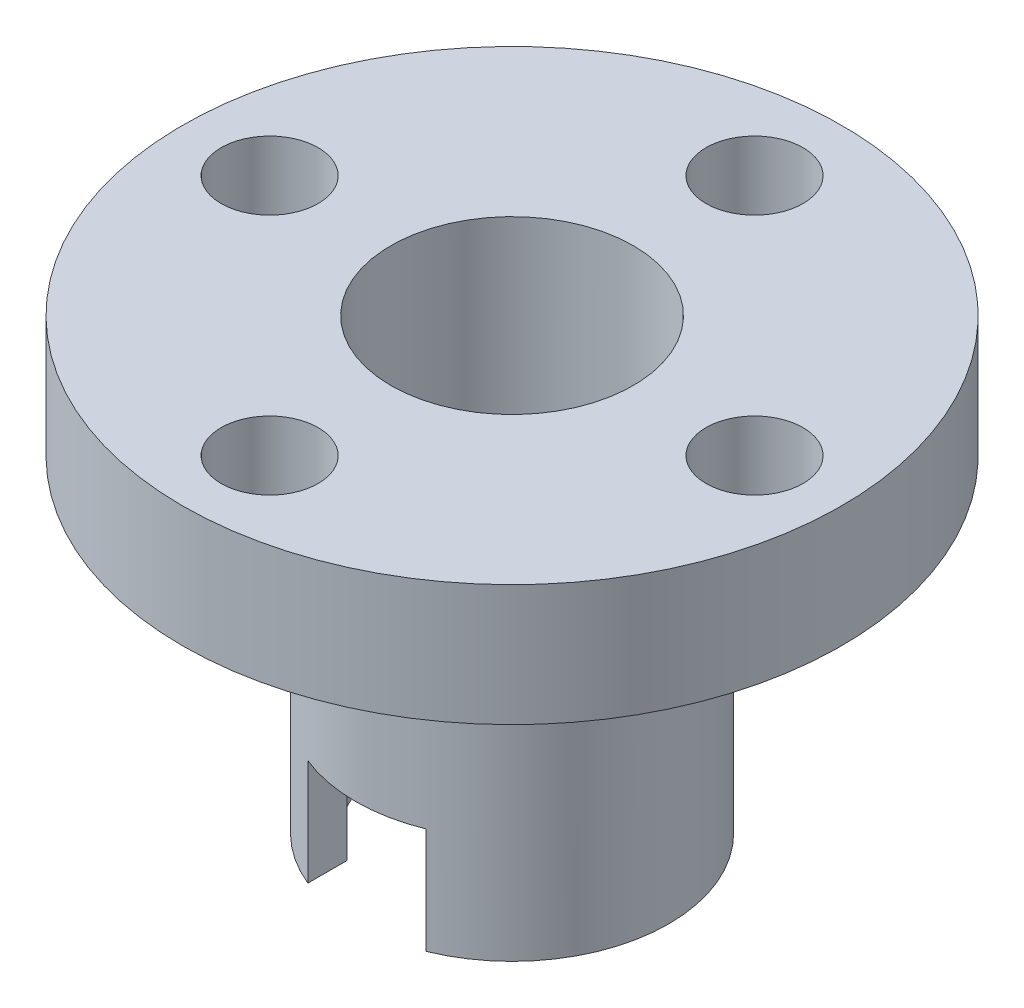
ISO-10303-21;
HEADER;
FILE_DESCRIPTION(('STEP AP214'),'2;1');
FILE_NAME('part.step','',(''),(''),'','','');
FILE_SCHEMA(('AUTOMOTIVE_DESIGN { 1 0 10303 214 1 1 1 1 }'));
ENDSEC;
DATA;
#1=APPLICATION_CONTEXT('core data for automotive mechanical design processes');
#2=APPLICATION_PROTOCOL_DEFINITION('international standard','automotive_design',2000,#1);
#3=PRODUCT_CONTEXT('',#1,'mechanical');
#4=PRODUCT('Part','Part','',(#3));
#5=PRODUCT_RELATED_PRODUCT_CATEGORY('part','',(#4));
#6=PRODUCT_DEFINITION_FORMATION('','',#4);
#7=PRODUCT_DEFINITION_CONTEXT('part definition',#1,'design');
#8=PRODUCT_DEFINITION('design','',#6,#7);
#9=PRODUCT_DEFINITION_SHAPE('','',#8);
#10=(LENGTH_UNIT() NAMED_UNIT(*) SI_UNIT(.MILLI.,.METRE.));
#11=(NAMED_UNIT(*) PLANE_ANGLE_UNIT() SI_UNIT($,.RADIAN.));
#12=(NAMED_UNIT(*) SI_UNIT($,.STERADIAN.) SOLID_ANGLE_UNIT());
#13=UNCERTAINTY_MEASURE_WITH_UNIT(LENGTH_MEASURE(1.E-05),#10,'distance_accuracy_value','');
#14=(GEOMETRIC_REPRESENTATION_CONTEXT(3) GLOBAL_UNCERTAINTY_ASSIGNED_CONTEXT((#13)) GLOBAL_UNIT_ASSIGNED_CONTEXT((#10,
#11,#12)) REPRESENTATION_CONTEXT('',''));
#15=CARTESIAN_POINT('',(0.,0.,0.));
#16=DIRECTION('',(0.,0.,1.));
#17=DIRECTION('',(1.,0.,0.));
#18=AXIS2_PLACEMENT_3D('',#15,#16,#17);
#19=CARTESIAN_POINT('',(0.,0.,0.));
#20=DIRECTION('',(0.,1.,0.));
#21=DIRECTION('',(0.,0.,1.));
#22=AXIS2_PLACEMENT_3D('',#19,#20,#21);
#23=PLANE('',#22);
#24=CARTESIAN_POINT('',(0.,0.,-8.));
#25=DIRECTION('',(0.,1.,0.));
#26=DIRECTION('',(0.,0.,1.));
#27=AXIS2_PLACEMENT_3D('',#24,#25,#26);
#28=CIRCLE('',#27,1.6);
#29=CARTESIAN_POINT('',(0.,0.,-6.4));
#30=VERTEX_POINT('',#29);
#31=EDGE_CURVE('E149',#30,#30,#28,.T.);
#32=ORIENTED_EDGE('',*,*,#31,.T.);
#33=EDGE_LOOP('',(#32));
#34=FACE_BOUND('',#33,.T.);
#35=CARTESIAN_POINT('',(0.,0.,8.));
#36=DIRECTION('',(0.,1.,0.));
#37=DIRECTION('',(0.,0.,1.));
#38=AXIS2_PLACEMENT_3D('',#35,#36,#37);
#39=CIRCLE('',#38,1.6);
#40=CARTESIAN_POINT('',(0.,0.,9.6));
#41=VERTEX_POINT('',#40);
#42=EDGE_CURVE('E152',#41,#41,#39,.T.);
#43=ORIENTED_EDGE('',*,*,#42,.T.);
#44=EDGE_LOOP('',(#43));
#45=FACE_BOUND('',#44,.T.);
#46=CARTESIAN_POINT('',(-8.,0.,0.));
#47=DIRECTION('',(0.,1.,0.));
#48=DIRECTION('',(0.,0.,1.));
#49=AXIS2_PLACEMENT_3D('',#46,#47,#48);
#50=CIRCLE('',#49,1.6);
#51=CARTESIAN_POINT('',(-8.,0.,1.6));
#52=VERTEX_POINT('',#51);
#53=EDGE_CURVE('E155',#52,#52,#50,.T.);
#54=ORIENTED_EDGE('',*,*,#53,.T.);
#55=EDGE_LOOP('',(#54));
#56=FACE_BOUND('',#55,.T.);
#57=CARTESIAN_POINT('',(8.,0.,0.));
#58=DIRECTION('',(0.,1.,0.));
#59=DIRECTION('',(0.,0.,1.));
#60=AXIS2_PLACEMENT_3D('',#57,#58,#59);
#61=CIRCLE('',#60,1.6);
#62=CARTESIAN_POINT('',(8.,0.,1.6));
#63=VERTEX_POINT('',#62);
#64=EDGE_CURVE('E157',#63,#63,#61,.T.);
#65=ORIENTED_EDGE('',*,*,#64,.T.);
#66=EDGE_LOOP('',(#65));
#67=FACE_BOUND('',#66,.T.);
#68=CARTESIAN_POINT('',(0.,0.,0.));
#69=DIRECTION('',(0.,-1.,0.));
#70=DIRECTION('',(0.,0.,-1.));
#71=AXIS2_PLACEMENT_3D('',#68,#69,#70);
#72=CIRCLE('',#71,5.17);
#73=CARTESIAN_POINT('',(0.,0.,-5.17));
#74=VERTEX_POINT('',#73);
#75=EDGE_CURVE('E146',#74,#74,#72,.T.);
#76=ORIENTED_EDGE('',*,*,#75,.F.);
#77=EDGE_LOOP('',(#76));
#78=FACE_BOUND('',#77,.T.);
#79=CARTESIAN_POINT('',(0.,0.,0.));
#80=DIRECTION('',(0.,1.,0.));
#81=DIRECTION('',(0.,0.,1.));
#82=AXIS2_PLACEMENT_3D('',#79,#80,#81);
#83=CIRCLE('',#82,10.875);
#84=CARTESIAN_POINT('',(0.,0.,10.875));
#85=VERTEX_POINT('',#84);
#86=EDGE_CURVE('E19',#85,#85,#83,.T.);
#87=ORIENTED_EDGE('',*,*,#86,.F.);
#88=EDGE_LOOP('',(#87));
#89=FACE_BOUND('',#88,.T.);
#90=ADVANCED_FACE('F16',(#34,#45,#56,#67,#78,#89),#23,.F.);
#91=CARTESIAN_POINT('',(0.,0.,0.));
#92=DIRECTION('',(0.,1.,0.));
#93=DIRECTION('',(0.,0.,1.));
#94=AXIS2_PLACEMENT_3D('',#91,#92,#93);
#95=CYLINDRICAL_SURFACE('',#94,10.875);
#96=ORIENTED_EDGE('',*,*,#86,.T.);
#97=EDGE_LOOP('',(#96));
#98=FACE_BOUND('',#97,.T.);
#99=CARTESIAN_POINT('',(0.,4.,0.));
#100=DIRECTION('',(0.,1.,0.));
#101=DIRECTION('',(0.,0.,1.));
#102=AXIS2_PLACEMENT_3D('',#99,#100,#101);
#103=CIRCLE('',#102,10.875);
#104=CARTESIAN_POINT('',(0.,4.,10.875));
#105=VERTEX_POINT('',#104);
#106=EDGE_CURVE('E143',#105,#105,#103,.T.);
#107=ORIENTED_EDGE('',*,*,#106,.F.);
#108=EDGE_LOOP('',(#107));
#109=FACE_BOUND('',#108,.T.);
#110=ADVANCED_FACE('F164',(#98,#109),#95,.T.);
#111=CARTESIAN_POINT('',(8.,-27.0181398539629,0.));
#112=DIRECTION('',(0.,1.,0.));
#113=DIRECTION('',(0.,0.,1.));
#114=AXIS2_PLACEMENT_3D('',#111,#112,#113);
#115=CYLINDRICAL_SURFACE('',#114,1.6);
#116=CARTESIAN_POINT('',(8.,4.,0.));
#117=DIRECTION('',(0.,1.,0.));
#118=DIRECTION('',(0.,0.,1.));
#119=AXIS2_PLACEMENT_3D('',#116,#117,#118);
#120=CIRCLE('',#119,1.6);
#121=CARTESIAN_POINT('',(8.,4.,1.6));
#122=VERTEX_POINT('',#121);
#123=EDGE_CURVE('E140',#122,#122,#120,.F.);
#124=ORIENTED_EDGE('',*,*,#123,.F.);
#125=EDGE_LOOP('',(#124));
#126=FACE_BOUND('',#125,.T.);
#127=ORIENTED_EDGE('',*,*,#64,.F.);
#128=EDGE_LOOP('',(#127));
#129=FACE_BOUND('',#128,.T.);
#130=ADVANCED_FACE('F173',(#126,#129),#115,.F.);
#131=CARTESIAN_POINT('',(-8.,-27.0181398539629,0.));
#132=DIRECTION('',(0.,1.,0.));
#133=DIRECTION('',(0.,0.,1.));
#134=AXIS2_PLACEMENT_3D('',#131,#132,#133);
#135=CYLINDRICAL_SURFACE('',#134,1.6);
#136=CARTESIAN_POINT('',(-8.,4.,0.));
#137=DIRECTION('',(0.,1.,0.));
#138=DIRECTION('',(0.,0.,1.));
#139=AXIS2_PLACEMENT_3D('',#136,#137,#138);
#140=CIRCLE('',#139,1.6);
#141=CARTESIAN_POINT('',(-8.,4.,1.6));
#142=VERTEX_POINT('',#141);
#143=EDGE_CURVE('E137',#142,#142,#140,.F.);
#144=ORIENTED_EDGE('',*,*,#143,.F.);
#145=EDGE_LOOP('',(#144));
#146=FACE_BOUND('',#145,.T.);
#147=ORIENTED_EDGE('',*,*,#53,.F.);
#148=EDGE_LOOP('',(#147));
#149=FACE_BOUND('',#148,.T.);
#150=ADVANCED_FACE('F226',(#146,#149),#135,.F.);
#151=CARTESIAN_POINT('',(0.,-27.0181398539629,8.));
#152=DIRECTION('',(0.,1.,0.));
#153=DIRECTION('',(0.,0.,1.));
#154=AXIS2_PLACEMENT_3D('',#151,#152,#153);
#155=CYLINDRICAL_SURFACE('',#154,1.6);
#156=CARTESIAN_POINT('',(0.,4.,8.));
#157=DIRECTION('',(0.,1.,0.));
#158=DIRECTION('',(0.,0.,1.));
#159=AXIS2_PLACEMENT_3D('',#156,#157,#158);
#160=CIRCLE('',#159,1.6);
#161=CARTESIAN_POINT('',(0.,4.,9.6));
#162=VERTEX_POINT('',#161);
#163=EDGE_CURVE('E134',#162,#162,#160,.F.);
#164=ORIENTED_EDGE('',*,*,#163,.F.);
#165=EDGE_LOOP('',(#164));
#166=FACE_BOUND('',#165,.T.);
#167=ORIENTED_EDGE('',*,*,#42,.F.);
#168=EDGE_LOOP('',(#167));
#169=FACE_BOUND('',#168,.T.);
#170=ADVANCED_FACE('F222',(#166,#169),#155,.F.);
#171=CARTESIAN_POINT('',(0.,-27.0181398539629,-8.));
#172=DIRECTION('',(0.,1.,0.));
#173=DIRECTION('',(0.,0.,1.));
#174=AXIS2_PLACEMENT_3D('',#171,#172,#173);
#175=CYLINDRICAL_SURFACE('',#174,1.6);
#176=CARTESIAN_POINT('',(0.,4.,-8.));
#177=DIRECTION('',(0.,1.,0.));
#178=DIRECTION('',(0.,0.,1.));
#179=AXIS2_PLACEMENT_3D('',#176,#177,#178);
#180=CIRCLE('',#179,1.6);
#181=CARTESIAN_POINT('',(0.,4.,-6.4));
#182=VERTEX_POINT('',#181);
#183=EDGE_CURVE('E88',#182,#182,#180,.F.);
#184=ORIENTED_EDGE('',*,*,#183,.F.);
#185=EDGE_LOOP('',(#184));
#186=FACE_BOUND('',#185,.T.);
#187=ORIENTED_EDGE('',*,*,#31,.F.);
#188=EDGE_LOOP('',(#187));
#189=FACE_BOUND('',#188,.T.);
#190=ADVANCED_FACE('F218',(#186,#189),#175,.F.);
#191=CARTESIAN_POINT('',(0.,0.,0.));
#192=DIRECTION('',(0.,-1.,0.));
#193=DIRECTION('',(0.,0.,-1.));
#194=AXIS2_PLACEMENT_3D('',#191,#192,#193);
#195=CYLINDRICAL_SURFACE('',#194,5.17);
#196=ORIENTED_EDGE('',*,*,#75,.T.);
#197=EDGE_LOOP('',(#196));
#198=FACE_BOUND('',#197,.T.);
#199=DIRECTION('',(0.,1.,0.));
#200=VECTOR('',#199,1.);
#201=CARTESIAN_POINT('',(1.95,-9.05,-4.78815204436952));
#202=LINE('',#201,#200);
#203=CARTESIAN_POINT('',(1.95,-10.8,-4.78815204436952));
#204=VERTEX_POINT('',#203);
#205=CARTESIAN_POINT('',(1.95,-7.3,-4.78815204436952));
#206=VERTEX_POINT('',#205);
#207=EDGE_CURVE('E101',#204,#206,#202,.T.);
#208=ORIENTED_EDGE('',*,*,#207,.T.);
#209=CARTESIAN_POINT('',(0.,-7.3,0.));
#210=DIRECTION('',(0.,-1.,0.));
#211=DIRECTION('',(0.,0.,-1.));
#212=AXIS2_PLACEMENT_3D('',#209,#210,#211);
#213=CIRCLE('',#212,5.17);
#214=CARTESIAN_POINT('',(-1.95,-7.3,-4.78815204436952));
#215=VERTEX_POINT('',#214);
#216=EDGE_CURVE('E96',#206,#215,#213,.F.);
#217=ORIENTED_EDGE('',*,*,#216,.T.);
#218=DIRECTION('',(0.,1.,0.));
#219=VECTOR('',#218,1.);
#220=CARTESIAN_POINT('',(-1.95,-9.05,-4.78815204436952));
#221=LINE('',#220,#219);
#222=CARTESIAN_POINT('',(-1.95,-10.8,-4.78815204436952));
#223=VERTEX_POINT('',#222);
#224=EDGE_CURVE('E91',#215,#223,#221,.F.);
#225=ORIENTED_EDGE('',*,*,#224,.T.);
#226=CARTESIAN_POINT('',(0.,-10.8,0.));
#227=DIRECTION('',(0.,-1.,0.));
#228=DIRECTION('',(0.,0.,-1.));
#229=AXIS2_PLACEMENT_3D('',#226,#227,#228);
#230=CIRCLE('',#229,5.17);
#231=CARTESIAN_POINT('',(-1.95,-10.8,4.78815204436952));
#232=VERTEX_POINT('',#231);
#233=EDGE_CURVE('E79',#223,#232,#230,.F.);
#234=ORIENTED_EDGE('',*,*,#233,.T.);
#235=DIRECTION('',(0.,1.,0.));
#236=VECTOR('',#235,1.);
#237=CARTESIAN_POINT('',(-1.95,-9.05,4.78815204436952));
#238=LINE('',#237,#236);
#239=CARTESIAN_POINT('',(-1.95,-7.3,4.78815204436952));
#240=VERTEX_POINT('',#239);
#241=EDGE_CURVE('E109',#232,#240,#238,.T.);
#242=ORIENTED_EDGE('',*,*,#241,.T.);
#243=CARTESIAN_POINT('',(0.,-7.3,0.));
#244=DIRECTION('',(0.,-1.,0.));
#245=DIRECTION('',(0.,0.,-1.));
#246=AXIS2_PLACEMENT_3D('',#243,#244,#245);
#247=CIRCLE('',#246,5.17);
#248=CARTESIAN_POINT('',(1.95,-7.3,4.78815204436952));
#249=VERTEX_POINT('',#248);
#250=EDGE_CURVE('E130',#240,#249,#247,.F.);
#251=ORIENTED_EDGE('',*,*,#250,.T.);
#252=DIRECTION('',(0.,1.,0.));
#253=VECTOR('',#252,1.);
#254=CARTESIAN_POINT('',(1.95,-9.05,4.78815204436952));
#255=LINE('',#254,#253);
#256=CARTESIAN_POINT('',(1.95,-10.8,4.78815204436952));
#257=VERTEX_POINT('',#256);
#258=EDGE_CURVE('E105',#249,#257,#255,.F.);
#259=ORIENTED_EDGE('',*,*,#258,.T.);
#260=CARTESIAN_POINT('',(0.,-10.8,0.));
#261=DIRECTION('',(0.,-1.,0.));
#262=DIRECTION('',(0.,0.,-1.));
#263=AXIS2_PLACEMENT_3D('',#260,#261,#262);
#264=CIRCLE('',#263,5.17);
#265=EDGE_CURVE('E128',#257,#204,#264,.F.);
#266=ORIENTED_EDGE('',*,*,#265,.T.);
#267=EDGE_LOOP('',(#208,#217,#225,#234,#242,#251,#259,#266));
#268=FACE_BOUND('',#267,.T.);
#269=ADVANCED_FACE('F94',(#198,#268),#195,.T.);
#270=CARTESIAN_POINT('',(0.,4.,0.));
#271=DIRECTION('',(0.,1.,0.));
#272=DIRECTION('',(0.,0.,1.));
#273=AXIS2_PLACEMENT_3D('',#270,#271,#272);
#274=PLANE('',#273);
#275=CARTESIAN_POINT('',(0.,4.,0.));
#276=DIRECTION('',(0.,1.,0.));
#277=DIRECTION('',(0.,0.,1.));
#278=AXIS2_PLACEMENT_3D('',#275,#276,#277);
#279=CIRCLE('',#278,4.);
#280=CARTESIAN_POINT('',(0.,4.,4.));
#281=VERTEX_POINT('',#280);
#282=EDGE_CURVE('E92',#281,#281,#279,.F.);
#283=ORIENTED_EDGE('',*,*,#282,.T.);
#284=EDGE_LOOP('',(#283));
#285=FACE_BOUND('',#284,.T.);
#286=ORIENTED_EDGE('',*,*,#183,.T.);
#287=EDGE_LOOP('',(#286));
#288=FACE_BOUND('',#287,.T.);
#289=ORIENTED_EDGE('',*,*,#163,.T.);
#290=EDGE_LOOP('',(#289));
#291=FACE_BOUND('',#290,.T.);
#292=ORIENTED_EDGE('',*,*,#143,.T.);
#293=EDGE_LOOP('',(#292));
#294=FACE_BOUND('',#293,.T.);
#295=ORIENTED_EDGE('',*,*,#123,.T.);
#296=EDGE_LOOP('',(#295));
#297=FACE_BOUND('',#296,.T.);
#298=ORIENTED_EDGE('',*,*,#106,.T.);
#299=EDGE_LOOP('',(#298));
#300=FACE_BOUND('',#299,.T.);
#301=ADVANCED_FACE('F212',(#285,#288,#291,#294,#297,#300),#274,.T.);
#302=CARTESIAN_POINT('',(0.,-10.8,0.));
#303=DIRECTION('',(0.,1.,0.));
#304=DIRECTION('',(0.,0.,1.));
#305=AXIS2_PLACEMENT_3D('',#302,#303,#304);
#306=PLANE('',#305);
#307=CARTESIAN_POINT('',(0.,-10.8,0.));
#308=DIRECTION('',(0.,1.,0.));
#309=DIRECTION('',(0.,0.,1.));
#310=AXIS2_PLACEMENT_3D('',#307,#308,#309);
#311=CIRCLE('',#310,4.);
#312=CARTESIAN_POINT('',(-1.95,-10.8,-3.49249194702006));
#313=VERTEX_POINT('',#312);
#314=CARTESIAN_POINT('',(-1.95,-10.8,3.49249194702006));
#315=VERTEX_POINT('',#314);
#316=EDGE_CURVE('E123',#313,#315,#311,.T.);
#317=ORIENTED_EDGE('',*,*,#316,.T.);
#318=DIRECTION('',(0.,0.,1.));
#319=VECTOR('',#318,1.);
#320=CARTESIAN_POINT('',(-1.95,-10.8,0.));
#321=LINE('',#320,#319);
#322=EDGE_CURVE('E84',#315,#232,#321,.T.);
#323=ORIENTED_EDGE('',*,*,#322,.T.);
#324=ORIENTED_EDGE('',*,*,#233,.F.);
#325=DIRECTION('',(0.,0.,1.));
#326=VECTOR('',#325,1.);
#327=CARTESIAN_POINT('',(-1.95,-10.8,0.));
#328=LINE('',#327,#326);
#329=EDGE_CURVE('E83',#223,#313,#328,.T.);
#330=ORIENTED_EDGE('',*,*,#329,.T.);
#331=EDGE_LOOP('',(#317,#323,#324,#330));
#332=FACE_BOUND('',#331,.T.);
#333=ADVANCED_FACE('F82',(#332),#306,.F.);
#334=CARTESIAN_POINT('',(-1.95,-9.05,0.));
#335=DIRECTION('',(-1.,0.,0.));
#336=DIRECTION('',(0.,0.,1.));
#337=AXIS2_PLACEMENT_3D('',#334,#335,#336);
#338=PLANE('',#337);
#339=DIRECTION('',(0.,0.,1.));
#340=VECTOR('',#339,1.);
#341=CARTESIAN_POINT('',(-1.95,-7.3,-5.17));
#342=LINE('',#341,#340);
#343=CARTESIAN_POINT('',(-1.95,-7.3,3.49249194702006));
#344=VERTEX_POINT('',#343);
#345=EDGE_CURVE('E111',#344,#240,#342,.T.);
#346=ORIENTED_EDGE('',*,*,#345,.T.);
#347=ORIENTED_EDGE('',*,*,#241,.F.);
#348=ORIENTED_EDGE('',*,*,#322,.F.);
#349=DIRECTION('',(0.,1.,0.));
#350=VECTOR('',#349,1.);
#351=CARTESIAN_POINT('',(-1.95,0.,3.49249194702006));
#352=LINE('',#351,#350);
#353=EDGE_CURVE('E122',#315,#344,#352,.T.);
#354=ORIENTED_EDGE('',*,*,#353,.T.);
#355=EDGE_LOOP('',(#346,#347,#348,#354));
#356=FACE_BOUND('',#355,.T.);
#357=ADVANCED_FACE('F205',(#356),#338,.F.);
#358=CARTESIAN_POINT('',(0.,-7.3,-5.17));
#359=DIRECTION('',(0.,1.,0.));
#360=DIRECTION('',(0.,0.,1.));
#361=AXIS2_PLACEMENT_3D('',#358,#359,#360);
#362=PLANE('',#361);
#363=DIRECTION('',(0.,0.,-1.));
#364=VECTOR('',#363,1.);
#365=CARTESIAN_POINT('',(1.95,-7.3,0.));
#366=LINE('',#365,#364);
#367=CARTESIAN_POINT('',(1.95,-7.3,3.49249194702006));
#368=VERTEX_POINT('',#367);
#369=EDGE_CURVE('E108',#368,#249,#366,.F.);
#370=ORIENTED_EDGE('',*,*,#369,.T.);
#371=ORIENTED_EDGE('',*,*,#250,.F.);
#372=ORIENTED_EDGE('',*,*,#345,.F.);
#373=CARTESIAN_POINT('',(0.,-7.3,0.));
#374=DIRECTION('',(0.,1.,0.));
#375=DIRECTION('',(0.,0.,1.));
#376=AXIS2_PLACEMENT_3D('',#373,#374,#375);
#377=CIRCLE('',#376,4.);
#378=EDGE_CURVE('E119',#344,#368,#377,.T.);
#379=ORIENTED_EDGE('',*,*,#378,.T.);
#380=EDGE_LOOP('',(#370,#371,#372,#379));
#381=FACE_BOUND('',#380,.T.);
#382=ADVANCED_FACE('F201',(#381),#362,.F.);
#383=CARTESIAN_POINT('',(1.95,-9.05,0.));
#384=DIRECTION('',(1.,0.,0.));
#385=DIRECTION('',(0.,0.,-1.));
#386=AXIS2_PLACEMENT_3D('',#383,#384,#385);
#387=PLANE('',#386);
#388=DIRECTION('',(0.,0.,1.));
#389=VECTOR('',#388,1.);
#390=CARTESIAN_POINT('',(1.95,-10.8,0.));
#391=LINE('',#390,#389);
#392=CARTESIAN_POINT('',(1.95,-10.8,3.49249194702006));
#393=VERTEX_POINT('',#392);
#394=EDGE_CURVE('E107',#393,#257,#391,.T.);
#395=ORIENTED_EDGE('',*,*,#394,.T.);
#396=ORIENTED_EDGE('',*,*,#258,.F.);
#397=ORIENTED_EDGE('',*,*,#369,.F.);
#398=DIRECTION('',(0.,1.,0.));
#399=VECTOR('',#398,1.);
#400=CARTESIAN_POINT('',(1.95,0.,3.49249194702006));
#401=LINE('',#400,#399);
#402=EDGE_CURVE('E118',#368,#393,#401,.F.);
#403=ORIENTED_EDGE('',*,*,#402,.T.);
#404=EDGE_LOOP('',(#395,#396,#397,#403));
#405=FACE_BOUND('',#404,.T.);
#406=ADVANCED_FACE('F197',(#405),#387,.F.);
#407=CARTESIAN_POINT('',(0.,-10.8,0.));
#408=DIRECTION('',(0.,1.,0.));
#409=DIRECTION('',(0.,0.,1.));
#410=AXIS2_PLACEMENT_3D('',#407,#408,#409);
#411=PLANE('',#410);
#412=ORIENTED_EDGE('',*,*,#265,.F.);
#413=ORIENTED_EDGE('',*,*,#394,.F.);
#414=CARTESIAN_POINT('',(0.,-10.8,0.));
#415=DIRECTION('',(0.,1.,0.));
#416=DIRECTION('',(0.,0.,1.));
#417=AXIS2_PLACEMENT_3D('',#414,#415,#416);
#418=CIRCLE('',#417,4.);
#419=CARTESIAN_POINT('',(1.95,-10.8,-3.49249194702006));
#420=VERTEX_POINT('',#419);
#421=EDGE_CURVE('E115',#393,#420,#418,.T.);
#422=ORIENTED_EDGE('',*,*,#421,.T.);
#423=DIRECTION('',(0.,0.,-1.));
#424=VECTOR('',#423,1.);
#425=CARTESIAN_POINT('',(1.95,-10.8,0.));
#426=LINE('',#425,#424);
#427=EDGE_CURVE('E104',#420,#204,#426,.T.);
#428=ORIENTED_EDGE('',*,*,#427,.T.);
#429=EDGE_LOOP('',(#412,#413,#422,#428));
#430=FACE_BOUND('',#429,.T.);
#431=ADVANCED_FACE('F193',(#430),#411,.F.);
#432=CARTESIAN_POINT('',(1.95,-9.05,0.));
#433=DIRECTION('',(1.,0.,0.));
#434=DIRECTION('',(0.,0.,-1.));
#435=AXIS2_PLACEMENT_3D('',#432,#433,#434);
#436=PLANE('',#435);
#437=DIRECTION('',(0.,0.,1.));
#438=VECTOR('',#437,1.);
#439=CARTESIAN_POINT('',(1.95,-7.3,-5.17));
#440=LINE('',#439,#438);
#441=CARTESIAN_POINT('',(1.95,-7.3,-3.49249194702006));
#442=VERTEX_POINT('',#441);
#443=EDGE_CURVE('E103',#442,#206,#440,.F.);
#444=ORIENTED_EDGE('',*,*,#443,.T.);
#445=ORIENTED_EDGE('',*,*,#207,.F.);
#446=ORIENTED_EDGE('',*,*,#427,.F.);
#447=DIRECTION('',(0.,1.,0.));
#448=VECTOR('',#447,1.);
#449=CARTESIAN_POINT('',(1.95,0.,-3.49249194702006));
#450=LINE('',#449,#448);
#451=EDGE_CURVE('E114',#420,#442,#450,.T.);
#452=ORIENTED_EDGE('',*,*,#451,.T.);
#453=EDGE_LOOP('',(#444,#445,#446,#452));
#454=FACE_BOUND('',#453,.T.);
#455=ADVANCED_FACE('F189',(#454),#436,.F.);
#456=CARTESIAN_POINT('',(0.,-7.3,-5.17));
#457=DIRECTION('',(0.,1.,0.));
#458=DIRECTION('',(0.,0.,1.));
#459=AXIS2_PLACEMENT_3D('',#456,#457,#458);
#460=PLANE('',#459);
#461=DIRECTION('',(0.,0.,1.));
#462=VECTOR('',#461,1.);
#463=CARTESIAN_POINT('',(-1.95,-7.3,0.));
#464=LINE('',#463,#462);
#465=CARTESIAN_POINT('',(-1.95,-7.3,-3.49249194702006));
#466=VERTEX_POINT('',#465);
#467=EDGE_CURVE('E33',#466,#215,#464,.F.);
#468=ORIENTED_EDGE('',*,*,#467,.T.);
#469=ORIENTED_EDGE('',*,*,#216,.F.);
#470=ORIENTED_EDGE('',*,*,#443,.F.);
#471=CARTESIAN_POINT('',(0.,-7.3,0.));
#472=DIRECTION('',(0.,1.,0.));
#473=DIRECTION('',(0.,0.,1.));
#474=AXIS2_PLACEMENT_3D('',#471,#472,#473);
#475=CIRCLE('',#474,4.);
#476=EDGE_CURVE('E25',#442,#466,#475,.T.);
#477=ORIENTED_EDGE('',*,*,#476,.T.);
#478=EDGE_LOOP('',(#468,#469,#470,#477));
#479=FACE_BOUND('',#478,.T.);
#480=ADVANCED_FACE('F182',(#479),#460,.F.);
#481=CARTESIAN_POINT('',(-1.95,-9.05,0.));
#482=DIRECTION('',(-1.,0.,0.));
#483=DIRECTION('',(0.,0.,1.));
#484=AXIS2_PLACEMENT_3D('',#481,#482,#483);
#485=PLANE('',#484);
#486=ORIENTED_EDGE('',*,*,#329,.F.);
#487=ORIENTED_EDGE('',*,*,#224,.F.);
#488=ORIENTED_EDGE('',*,*,#467,.F.);
#489=DIRECTION('',(0.,1.,0.));
#490=VECTOR('',#489,1.);
#491=CARTESIAN_POINT('',(-1.95,0.,-3.49249194702006));
#492=LINE('',#491,#490);
#493=EDGE_CURVE('E11',#466,#313,#492,.F.);
#494=ORIENTED_EDGE('',*,*,#493,.T.);
#495=EDGE_LOOP('',(#486,#487,#488,#494));
#496=FACE_BOUND('',#495,.T.);
#497=ADVANCED_FACE('F90',(#496),#485,.F.);
#498=CARTESIAN_POINT('',(0.,0.,0.));
#499=DIRECTION('',(0.,1.,0.));
#500=DIRECTION('',(0.,0.,1.));
#501=AXIS2_PLACEMENT_3D('',#498,#499,#500);
#502=CYLINDRICAL_SURFACE('',#501,4.);
#503=ORIENTED_EDGE('',*,*,#476,.F.);
#504=ORIENTED_EDGE('',*,*,#451,.F.);
#505=ORIENTED_EDGE('',*,*,#421,.F.);
#506=ORIENTED_EDGE('',*,*,#402,.F.);
#507=ORIENTED_EDGE('',*,*,#378,.F.);
#508=ORIENTED_EDGE('',*,*,#353,.F.);
#509=ORIENTED_EDGE('',*,*,#316,.F.);
#510=ORIENTED_EDGE('',*,*,#493,.F.);
#511=EDGE_LOOP('',(#503,#504,#505,#506,#507,#508,#509,#510));
#512=FACE_BOUND('',#511,.T.);
#513=ORIENTED_EDGE('',*,*,#282,.F.);
#514=EDGE_LOOP('',(#513));
#515=FACE_BOUND('',#514,.T.);
#516=ADVANCED_FACE('F175',(#512,#515),#502,.F.);
#517=CLOSED_SHELL('',(#90,#110,#130,#150,#170,#190,#269,#301,#333,#357,#382,#406,#431,#455,#480,
#497,#516));
#518=MANIFOLD_SOLID_BREP('B1',#517);
#519=ADVANCED_BREP_SHAPE_REPRESENTATION('',(#18,#518),#14);
#520=SHAPE_DEFINITION_REPRESENTATION(#9,#519);
ENDSEC;
END-ISO-10303-21;
